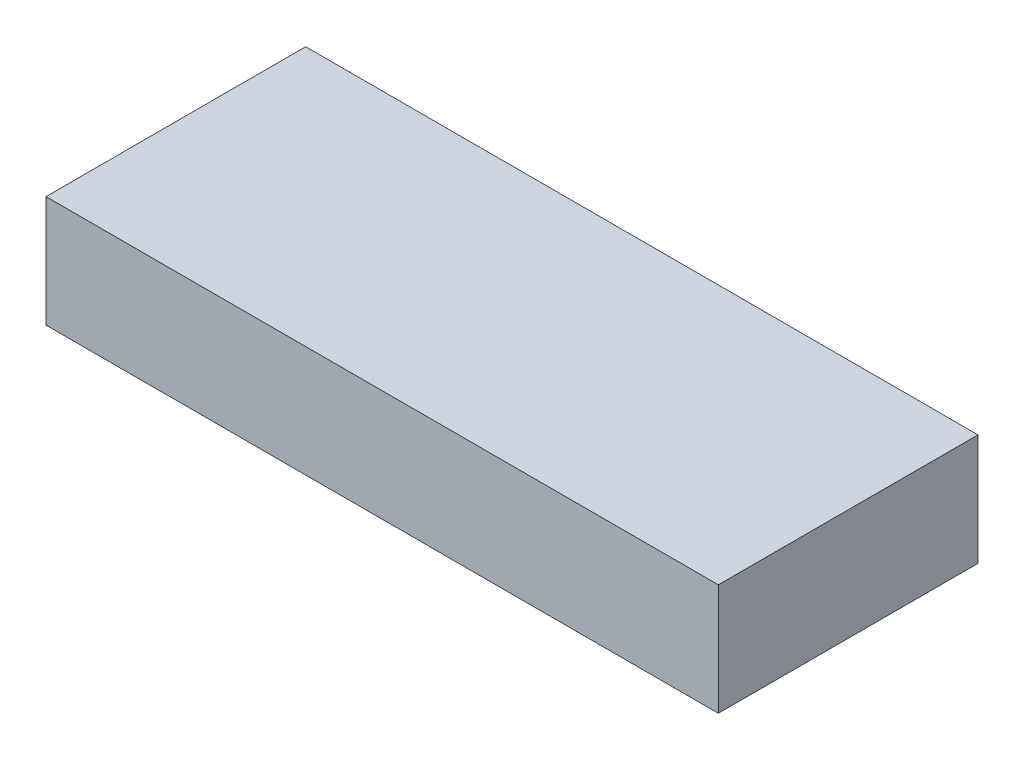
ISO-10303-21;
HEADER;
FILE_DESCRIPTION(('STEP AP214'),'2;1');
FILE_NAME('part.step','',(''),(''),'','','');
FILE_SCHEMA(('AUTOMOTIVE_DESIGN { 1 0 10303 214 1 1 1 1 }'));
ENDSEC;
DATA;
#1=APPLICATION_CONTEXT('core data for automotive mechanical design processes');
#2=APPLICATION_PROTOCOL_DEFINITION('international standard','automotive_design',2000,#1);
#3=PRODUCT_CONTEXT('',#1,'mechanical');
#4=PRODUCT('Part','Part','',(#3));
#5=PRODUCT_RELATED_PRODUCT_CATEGORY('part','',(#4));
#6=PRODUCT_DEFINITION_FORMATION('','',#4);
#7=PRODUCT_DEFINITION_CONTEXT('part definition',#1,'design');
#8=PRODUCT_DEFINITION('design','',#6,#7);
#9=PRODUCT_DEFINITION_SHAPE('','',#8);
#10=(LENGTH_UNIT() NAMED_UNIT(*) SI_UNIT(.MILLI.,.METRE.));
#11=(NAMED_UNIT(*) PLANE_ANGLE_UNIT() SI_UNIT($,.RADIAN.));
#12=(NAMED_UNIT(*) SI_UNIT($,.STERADIAN.) SOLID_ANGLE_UNIT());
#13=UNCERTAINTY_MEASURE_WITH_UNIT(LENGTH_MEASURE(1.E-05),#10,'distance_accuracy_value','');
#14=(GEOMETRIC_REPRESENTATION_CONTEXT(3) GLOBAL_UNCERTAINTY_ASSIGNED_CONTEXT((#13)) GLOBAL_UNIT_ASSIGNED_CONTEXT((#10,
#11,#12)) REPRESENTATION_CONTEXT('',''));
#15=CARTESIAN_POINT('',(0.,0.,0.));
#16=DIRECTION('',(0.,0.,1.));
#17=DIRECTION('',(1.,0.,0.));
#18=AXIS2_PLACEMENT_3D('',#15,#16,#17);
#19=CARTESIAN_POINT('',(0.,38.1,0.));
#20=DIRECTION('',(1.,0.,0.));
#21=DIRECTION('',(0.,0.,-1.));
#22=AXIS2_PLACEMENT_3D('',#19,#20,#21);
#23=PLANE('',#22);
#24=DIRECTION('',(0.,0.,1.));
#25=VECTOR('',#24,1.);
#26=CARTESIAN_POINT('',(0.,0.,0.));
#27=LINE('',#26,#25);
#28=CARTESIAN_POINT('',(0.,0.,-88.9));
#29=VERTEX_POINT('',#28);
#30=CARTESIAN_POINT('',(0.,0.,0.));
#31=VERTEX_POINT('',#30);
#32=EDGE_CURVE('E101',#29,#31,#27,.T.);
#33=ORIENTED_EDGE('',*,*,#32,.T.);
#34=DIRECTION('',(0.,-1.,0.));
#35=VECTOR('',#34,1.);
#36=CARTESIAN_POINT('',(0.,38.1,0.));
#37=LINE('',#36,#35);
#38=CARTESIAN_POINT('',(0.,38.1,0.));
#39=VERTEX_POINT('',#38);
#40=EDGE_CURVE('E11',#39,#31,#37,.T.);
#41=ORIENTED_EDGE('',*,*,#40,.F.);
#42=DIRECTION('',(0.,0.,1.));
#43=VECTOR('',#42,1.);
#44=CARTESIAN_POINT('',(0.,38.1,0.));
#45=LINE('',#44,#43);
#46=CARTESIAN_POINT('',(0.,38.1,-88.9));
#47=VERTEX_POINT('',#46);
#48=EDGE_CURVE('E89',#47,#39,#45,.T.);
#49=ORIENTED_EDGE('',*,*,#48,.F.);
#50=DIRECTION('',(0.,-1.,0.));
#51=VECTOR('',#50,1.);
#52=CARTESIAN_POINT('',(0.,38.1,-88.9));
#53=LINE('',#52,#51);
#54=EDGE_CURVE('E97',#47,#29,#53,.T.);
#55=ORIENTED_EDGE('',*,*,#54,.T.);
#56=EDGE_LOOP('',(#33,#41,#49,#55));
#57=FACE_BOUND('',#56,.T.);
#58=ADVANCED_FACE('F38',(#57),#23,.F.);
#59=CARTESIAN_POINT('',(0.,38.1,0.));
#60=DIRECTION('',(0.,0.,-1.));
#61=DIRECTION('',(-1.,0.,0.));
#62=AXIS2_PLACEMENT_3D('',#59,#60,#61);
#63=PLANE('',#62);
#64=DIRECTION('',(1.,0.,0.));
#65=VECTOR('',#64,1.);
#66=CARTESIAN_POINT('',(0.,0.,0.));
#67=LINE('',#66,#65);
#68=CARTESIAN_POINT('',(230.1875,0.,0.));
#69=VERTEX_POINT('',#68);
#70=EDGE_CURVE('E93',#31,#69,#67,.T.);
#71=ORIENTED_EDGE('',*,*,#70,.T.);
#72=DIRECTION('',(0.,-1.,0.));
#73=VECTOR('',#72,1.);
#74=CARTESIAN_POINT('',(230.1875,38.1,0.));
#75=LINE('',#74,#73);
#76=CARTESIAN_POINT('',(230.1875,38.1,0.));
#77=VERTEX_POINT('',#76);
#78=EDGE_CURVE('E46',#77,#69,#75,.T.);
#79=ORIENTED_EDGE('',*,*,#78,.F.);
#80=DIRECTION('',(1.,0.,0.));
#81=VECTOR('',#80,1.);
#82=CARTESIAN_POINT('',(0.,38.1,0.));
#83=LINE('',#82,#81);
#84=EDGE_CURVE('E84',#39,#77,#83,.T.);
#85=ORIENTED_EDGE('',*,*,#84,.F.);
#86=ORIENTED_EDGE('',*,*,#40,.T.);
#87=EDGE_LOOP('',(#71,#79,#85,#86));
#88=FACE_BOUND('',#87,.T.);
#89=ADVANCED_FACE('F92',(#88),#63,.F.);
#90=CARTESIAN_POINT('',(230.1875,38.1,0.));
#91=DIRECTION('',(-1.,0.,0.));
#92=DIRECTION('',(0.,0.,1.));
#93=AXIS2_PLACEMENT_3D('',#90,#91,#92);
#94=PLANE('',#93);
#95=DIRECTION('',(0.,0.,-1.));
#96=VECTOR('',#95,1.);
#97=CARTESIAN_POINT('',(230.1875,0.,0.));
#98=LINE('',#97,#96);
#99=CARTESIAN_POINT('',(230.1875,0.,-88.9));
#100=VERTEX_POINT('',#99);
#101=EDGE_CURVE('E71',#69,#100,#98,.T.);
#102=ORIENTED_EDGE('',*,*,#101,.T.);
#103=DIRECTION('',(0.,-1.,0.));
#104=VECTOR('',#103,1.);
#105=CARTESIAN_POINT('',(230.1875,38.1,-88.9));
#106=LINE('',#105,#104);
#107=CARTESIAN_POINT('',(230.1875,38.1,-88.9));
#108=VERTEX_POINT('',#107);
#109=EDGE_CURVE('E94',#108,#100,#106,.T.);
#110=ORIENTED_EDGE('',*,*,#109,.F.);
#111=DIRECTION('',(0.,0.,-1.));
#112=VECTOR('',#111,1.);
#113=CARTESIAN_POINT('',(230.1875,38.1,0.));
#114=LINE('',#113,#112);
#115=EDGE_CURVE('E87',#77,#108,#114,.T.);
#116=ORIENTED_EDGE('',*,*,#115,.F.);
#117=ORIENTED_EDGE('',*,*,#78,.T.);
#118=EDGE_LOOP('',(#102,#110,#116,#117));
#119=FACE_BOUND('',#118,.T.);
#120=ADVANCED_FACE('F95',(#119),#94,.F.);
#121=CARTESIAN_POINT('',(0.,38.1,-88.9));
#122=DIRECTION('',(0.,0.,1.));
#123=DIRECTION('',(1.,0.,0.));
#124=AXIS2_PLACEMENT_3D('',#121,#122,#123);
#125=PLANE('',#124);
#126=DIRECTION('',(-1.,0.,0.));
#127=VECTOR('',#126,1.);
#128=CARTESIAN_POINT('',(0.,0.,-88.9));
#129=LINE('',#128,#127);
#130=EDGE_CURVE('E77',#100,#29,#129,.T.);
#131=ORIENTED_EDGE('',*,*,#130,.T.);
#132=ORIENTED_EDGE('',*,*,#54,.F.);
#133=DIRECTION('',(-1.,0.,0.));
#134=VECTOR('',#133,1.);
#135=CARTESIAN_POINT('',(0.,38.1,-88.9));
#136=LINE('',#135,#134);
#137=EDGE_CURVE('E54',#108,#47,#136,.T.);
#138=ORIENTED_EDGE('',*,*,#137,.F.);
#139=ORIENTED_EDGE('',*,*,#109,.T.);
#140=EDGE_LOOP('',(#131,#132,#138,#139));
#141=FACE_BOUND('',#140,.T.);
#142=ADVANCED_FACE('F108',(#141),#125,.F.);
#143=CARTESIAN_POINT('',(0.,38.1,0.));
#144=DIRECTION('',(0.,-1.,0.));
#145=DIRECTION('',(0.,0.,-1.));
#146=AXIS2_PLACEMENT_3D('',#143,#144,#145);
#147=PLANE('',#146);
#148=ORIENTED_EDGE('',*,*,#48,.T.);
#149=ORIENTED_EDGE('',*,*,#84,.T.);
#150=ORIENTED_EDGE('',*,*,#115,.T.);
#151=ORIENTED_EDGE('',*,*,#137,.T.);
#152=EDGE_LOOP('',(#148,#149,#150,#151));
#153=FACE_BOUND('',#152,.T.);
#154=ADVANCED_FACE('F85',(#153),#147,.F.);
#155=CARTESIAN_POINT('',(0.,0.,0.));
#156=DIRECTION('',(0.,-1.,0.));
#157=DIRECTION('',(0.,0.,-1.));
#158=AXIS2_PLACEMENT_3D('',#155,#156,#157);
#159=PLANE('',#158);
#160=ORIENTED_EDGE('',*,*,#32,.F.);
#161=ORIENTED_EDGE('',*,*,#130,.F.);
#162=ORIENTED_EDGE('',*,*,#101,.F.);
#163=ORIENTED_EDGE('',*,*,#70,.F.);
#164=EDGE_LOOP('',(#160,#161,#162,#163));
#165=FACE_BOUND('',#164,.T.);
#166=ADVANCED_FACE('F111',(#165),#159,.T.);
#167=CLOSED_SHELL('',(#58,#89,#120,#142,#154,#166));
#168=MANIFOLD_SOLID_BREP('B2',#167);
#169=ADVANCED_BREP_SHAPE_REPRESENTATION('',(#18,#168),#14);
#170=SHAPE_DEFINITION_REPRESENTATION(#9,#169);
ENDSEC;
END-ISO-10303-21;
